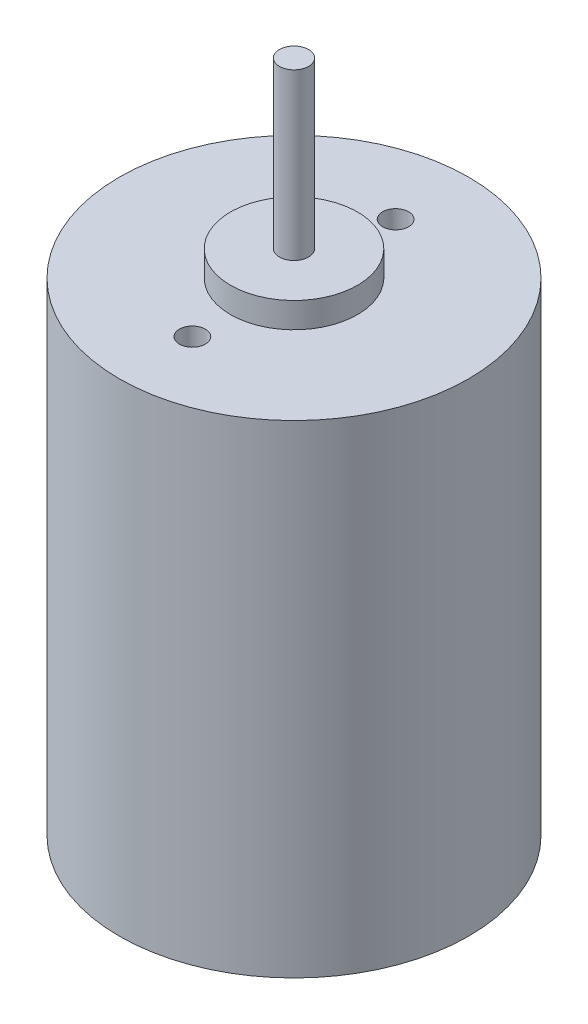
ISO-10303-21;
HEADER;
FILE_DESCRIPTION(('STEP AP214'),'2;1');
FILE_NAME('part.step','',(''),(''),'','','');
FILE_SCHEMA(('AUTOMOTIVE_DESIGN { 1 0 10303 214 1 1 1 1 }'));
ENDSEC;
DATA;
#1=APPLICATION_CONTEXT('core data for automotive mechanical design processes');
#2=APPLICATION_PROTOCOL_DEFINITION('international standard','automotive_design',2000,#1);
#3=PRODUCT_CONTEXT('',#1,'mechanical');
#4=PRODUCT('Part','Part','',(#3));
#5=PRODUCT_RELATED_PRODUCT_CATEGORY('part','',(#4));
#6=PRODUCT_DEFINITION_FORMATION('','',#4);
#7=PRODUCT_DEFINITION_CONTEXT('part definition',#1,'design');
#8=PRODUCT_DEFINITION('design','',#6,#7);
#9=PRODUCT_DEFINITION_SHAPE('','',#8);
#10=(LENGTH_UNIT() NAMED_UNIT(*) SI_UNIT(.MILLI.,.METRE.));
#11=(NAMED_UNIT(*) PLANE_ANGLE_UNIT() SI_UNIT($,.RADIAN.));
#12=(NAMED_UNIT(*) SI_UNIT($,.STERADIAN.) SOLID_ANGLE_UNIT());
#13=UNCERTAINTY_MEASURE_WITH_UNIT(LENGTH_MEASURE(1.E-05),#10,'distance_accuracy_value','');
#14=(GEOMETRIC_REPRESENTATION_CONTEXT(3) GLOBAL_UNCERTAINTY_ASSIGNED_CONTEXT((#13)) GLOBAL_UNIT_ASSIGNED_CONTEXT((#10,
#11,#12)) REPRESENTATION_CONTEXT('',''));
#15=CARTESIAN_POINT('',(0.,0.,0.));
#16=DIRECTION('',(0.,0.,1.));
#17=DIRECTION('',(1.,0.,0.));
#18=AXIS2_PLACEMENT_3D('',#15,#16,#17);
#19=CARTESIAN_POINT('',(0.,38.,0.));
#20=DIRECTION('',(0.,-1.,0.));
#21=DIRECTION('',(0.,0.,-1.));
#22=AXIS2_PLACEMENT_3D('',#19,#20,#21);
#23=CYLINDRICAL_SURFACE('',#22,13.75);
#24=CARTESIAN_POINT('',(0.,38.,0.));
#25=DIRECTION('',(0.,1.,0.));
#26=DIRECTION('',(0.,0.,1.));
#27=AXIS2_PLACEMENT_3D('',#24,#25,#26);
#28=CIRCLE('',#27,13.75);
#29=CARTESIAN_POINT('',(0.,38.,13.75));
#30=VERTEX_POINT('',#29);
#31=EDGE_CURVE('E83',#30,#30,#28,.T.);
#32=ORIENTED_EDGE('',*,*,#31,.F.);
#33=EDGE_LOOP('',(#32));
#34=FACE_BOUND('',#33,.T.);
#35=CARTESIAN_POINT('',(0.,0.,0.));
#36=DIRECTION('',(0.,1.,0.));
#37=DIRECTION('',(0.,0.,1.));
#38=AXIS2_PLACEMENT_3D('',#35,#36,#37);
#39=CIRCLE('',#38,13.75);
#40=CARTESIAN_POINT('',(0.,0.,13.75));
#41=VERTEX_POINT('',#40);
#42=EDGE_CURVE('E43',#41,#41,#39,.T.);
#43=ORIENTED_EDGE('',*,*,#42,.T.);
#44=EDGE_LOOP('',(#43));
#45=FACE_BOUND('',#44,.T.);
#46=ADVANCED_FACE('F40',(#34,#45),#23,.T.);
#47=CARTESIAN_POINT('',(0.,38.,0.));
#48=DIRECTION('',(0.,1.,0.));
#49=DIRECTION('',(0.,0.,1.));
#50=AXIS2_PLACEMENT_3D('',#47,#48,#49);
#51=PLANE('',#50);
#52=CARTESIAN_POINT('',(0.,38.,-8.));
#53=DIRECTION('',(0.,1.,0.));
#54=DIRECTION('',(0.,0.,1.));
#55=AXIS2_PLACEMENT_3D('',#52,#53,#54);
#56=CIRCLE('',#55,1.02499999999999);
#57=CARTESIAN_POINT('',(0.,38.,-6.97500000000001));
#58=VERTEX_POINT('',#57);
#59=EDGE_CURVE('E66',#58,#58,#56,.T.);
#60=ORIENTED_EDGE('',*,*,#59,.F.);
#61=EDGE_LOOP('',(#60));
#62=FACE_BOUND('',#61,.T.);
#63=CARTESIAN_POINT('',(0.,38.,8.));
#64=DIRECTION('',(0.,1.,0.));
#65=DIRECTION('',(0.,0.,1.));
#66=AXIS2_PLACEMENT_3D('',#63,#64,#65);
#67=CIRCLE('',#66,1.02499999999999);
#68=CARTESIAN_POINT('',(0.,38.,9.02499999999999));
#69=VERTEX_POINT('',#68);
#70=EDGE_CURVE('E65',#69,#69,#67,.T.);
#71=ORIENTED_EDGE('',*,*,#70,.F.);
#72=EDGE_LOOP('',(#71));
#73=FACE_BOUND('',#72,.T.);
#74=CARTESIAN_POINT('',(0.,38.,0.));
#75=DIRECTION('',(0.,1.,0.));
#76=DIRECTION('',(0.,0.,1.));
#77=AXIS2_PLACEMENT_3D('',#74,#75,#76);
#78=CIRCLE('',#77,5.);
#79=CARTESIAN_POINT('',(0.,38.,5.));
#80=VERTEX_POINT('',#79);
#81=EDGE_CURVE('E48',#80,#80,#78,.T.);
#82=ORIENTED_EDGE('',*,*,#81,.F.);
#83=EDGE_LOOP('',(#82));
#84=FACE_BOUND('',#83,.T.);
#85=ORIENTED_EDGE('',*,*,#31,.T.);
#86=EDGE_LOOP('',(#85));
#87=FACE_BOUND('',#86,.T.);
#88=ADVANCED_FACE('F94',(#62,#73,#84,#87),#51,.T.);
#89=CARTESIAN_POINT('',(0.,0.,0.));
#90=DIRECTION('',(0.,1.,0.));
#91=DIRECTION('',(0.,0.,1.));
#92=AXIS2_PLACEMENT_3D('',#89,#90,#91);
#93=PLANE('',#92);
#94=ORIENTED_EDGE('',*,*,#42,.F.);
#95=EDGE_LOOP('',(#94));
#96=FACE_BOUND('',#95,.T.);
#97=ADVANCED_FACE('F91',(#96),#93,.F.);
#98=CARTESIAN_POINT('',(0.,40.,0.));
#99=DIRECTION('',(0.,-1.,0.));
#100=DIRECTION('',(0.,0.,-1.));
#101=AXIS2_PLACEMENT_3D('',#98,#99,#100);
#102=CYLINDRICAL_SURFACE('',#101,5.);
#103=CARTESIAN_POINT('',(0.,40.,0.));
#104=DIRECTION('',(0.,1.,0.));
#105=DIRECTION('',(0.,0.,1.));
#106=AXIS2_PLACEMENT_3D('',#103,#104,#105);
#107=CIRCLE('',#106,5.);
#108=CARTESIAN_POINT('',(0.,40.,5.));
#109=VERTEX_POINT('',#108);
#110=EDGE_CURVE('E78',#109,#109,#107,.T.);
#111=ORIENTED_EDGE('',*,*,#110,.F.);
#112=EDGE_LOOP('',(#111));
#113=FACE_BOUND('',#112,.T.);
#114=ORIENTED_EDGE('',*,*,#81,.T.);
#115=EDGE_LOOP('',(#114));
#116=FACE_BOUND('',#115,.T.);
#117=ADVANCED_FACE('F93',(#113,#116),#102,.T.);
#118=CARTESIAN_POINT('',(0.,40.,0.));
#119=DIRECTION('',(0.,1.,0.));
#120=DIRECTION('',(0.,0.,1.));
#121=AXIS2_PLACEMENT_3D('',#118,#119,#120);
#122=PLANE('',#121);
#123=CARTESIAN_POINT('',(0.,40.,0.));
#124=DIRECTION('',(0.,1.,0.));
#125=DIRECTION('',(0.,0.,1.));
#126=AXIS2_PLACEMENT_3D('',#123,#124,#125);
#127=CIRCLE('',#126,1.15);
#128=CARTESIAN_POINT('',(0.,40.,1.15));
#129=VERTEX_POINT('',#128);
#130=EDGE_CURVE('E11',#129,#129,#127,.T.);
#131=ORIENTED_EDGE('',*,*,#130,.F.);
#132=EDGE_LOOP('',(#131));
#133=FACE_BOUND('',#132,.T.);
#134=ORIENTED_EDGE('',*,*,#110,.T.);
#135=EDGE_LOOP('',(#134));
#136=FACE_BOUND('',#135,.T.);
#137=ADVANCED_FACE('F99',(#133,#136),#122,.T.);
#138=CARTESIAN_POINT('',(0.,53.,0.));
#139=DIRECTION('',(0.,-1.,0.));
#140=DIRECTION('',(0.,0.,-1.));
#141=AXIS2_PLACEMENT_3D('',#138,#139,#140);
#142=CYLINDRICAL_SURFACE('',#141,1.15);
#143=CARTESIAN_POINT('',(0.,53.,0.));
#144=DIRECTION('',(0.,1.,0.));
#145=DIRECTION('',(0.,0.,1.));
#146=AXIS2_PLACEMENT_3D('',#143,#144,#145);
#147=CIRCLE('',#146,1.15);
#148=CARTESIAN_POINT('',(0.,53.,1.15));
#149=VERTEX_POINT('',#148);
#150=EDGE_CURVE('E76',#149,#149,#147,.T.);
#151=ORIENTED_EDGE('',*,*,#150,.F.);
#152=EDGE_LOOP('',(#151));
#153=FACE_BOUND('',#152,.T.);
#154=ORIENTED_EDGE('',*,*,#130,.T.);
#155=EDGE_LOOP('',(#154));
#156=FACE_BOUND('',#155,.T.);
#157=ADVANCED_FACE('F166',(#153,#156),#142,.T.);
#158=CARTESIAN_POINT('',(0.,53.,0.));
#159=DIRECTION('',(0.,1.,0.));
#160=DIRECTION('',(0.,0.,1.));
#161=AXIS2_PLACEMENT_3D('',#158,#159,#160);
#162=PLANE('',#161);
#163=ORIENTED_EDGE('',*,*,#150,.T.);
#164=EDGE_LOOP('',(#163));
#165=FACE_BOUND('',#164,.T.);
#166=ADVANCED_FACE('F119',(#165),#162,.T.);
#167=CARTESIAN_POINT('',(0.,34.25,8.));
#168=DIRECTION('',(0.,1.,0.));
#169=DIRECTION('',(0.,0.,1.));
#170=AXIS2_PLACEMENT_3D('',#167,#168,#169);
#171=CONICAL_SURFACE('',#170,1.02499999999999,1.02974425867665);
#172=CARTESIAN_POINT('',(0.,33.6341178654967,8.));
#173=VERTEX_POINT('',#172);
#174=VERTEX_LOOP('',#173);
#175=FACE_BOUND('',#174,.T.);
#176=CARTESIAN_POINT('',(0.,34.25,8.));
#177=DIRECTION('',(0.,1.,0.));
#178=DIRECTION('',(0.,0.,1.));
#179=AXIS2_PLACEMENT_3D('',#176,#177,#178);
#180=CIRCLE('',#179,1.02499999999999);
#181=CARTESIAN_POINT('',(0.,34.25,9.02499999999999));
#182=VERTEX_POINT('',#181);
#183=EDGE_CURVE('E69',#182,#182,#180,.T.);
#184=ORIENTED_EDGE('',*,*,#183,.T.);
#185=EDGE_LOOP('',(#184));
#186=FACE_BOUND('',#185,.T.);
#187=ADVANCED_FACE('F124',(#175,#186),#171,.F.);
#188=CARTESIAN_POINT('',(0.,38.,8.));
#189=DIRECTION('',(0.,1.,0.));
#190=DIRECTION('',(0.,0.,1.));
#191=AXIS2_PLACEMENT_3D('',#188,#189,#190);
#192=CYLINDRICAL_SURFACE('',#191,1.02499999999999);
#193=ORIENTED_EDGE('',*,*,#183,.F.);
#194=EDGE_LOOP('',(#193));
#195=FACE_BOUND('',#194,.T.);
#196=ORIENTED_EDGE('',*,*,#70,.T.);
#197=EDGE_LOOP('',(#196));
#198=FACE_BOUND('',#197,.T.);
#199=ADVANCED_FACE('F59',(#195,#198),#192,.F.);
#200=CARTESIAN_POINT('',(0.,34.25,-8.));
#201=DIRECTION('',(0.,1.,0.));
#202=DIRECTION('',(0.,0.,1.));
#203=AXIS2_PLACEMENT_3D('',#200,#201,#202);
#204=CONICAL_SURFACE('',#203,1.02499999999999,1.02974425867665);
#205=CARTESIAN_POINT('',(0.,33.6341178654967,-8.));
#206=VERTEX_POINT('',#205);
#207=VERTEX_LOOP('',#206);
#208=FACE_BOUND('',#207,.T.);
#209=CARTESIAN_POINT('',(0.,34.25,-8.));
#210=DIRECTION('',(0.,1.,0.));
#211=DIRECTION('',(0.,0.,1.));
#212=AXIS2_PLACEMENT_3D('',#209,#210,#211);
#213=CIRCLE('',#212,1.02499999999999);
#214=CARTESIAN_POINT('',(0.,34.25,-6.97500000000001));
#215=VERTEX_POINT('',#214);
#216=EDGE_CURVE('E63',#215,#215,#213,.T.);
#217=ORIENTED_EDGE('',*,*,#216,.T.);
#218=EDGE_LOOP('',(#217));
#219=FACE_BOUND('',#218,.T.);
#220=ADVANCED_FACE('F55',(#208,#219),#204,.F.);
#221=CARTESIAN_POINT('',(0.,38.,-8.));
#222=DIRECTION('',(0.,1.,0.));
#223=DIRECTION('',(0.,0.,1.));
#224=AXIS2_PLACEMENT_3D('',#221,#222,#223);
#225=CYLINDRICAL_SURFACE('',#224,1.02499999999999);
#226=ORIENTED_EDGE('',*,*,#216,.F.);
#227=EDGE_LOOP('',(#226));
#228=FACE_BOUND('',#227,.T.);
#229=ORIENTED_EDGE('',*,*,#59,.T.);
#230=EDGE_LOOP('',(#229));
#231=FACE_BOUND('',#230,.T.);
#232=ADVANCED_FACE('F58',(#228,#231),#225,.F.);
#233=CLOSED_SHELL('',(#46,#88,#97,#117,#137,#157,#166,#187,#199,#220,#232));
#234=MANIFOLD_SOLID_BREP('B2',#233);
#235=ADVANCED_BREP_SHAPE_REPRESENTATION('',(#18,#234),#14);
#236=SHAPE_DEFINITION_REPRESENTATION(#9,#235);
ENDSEC;
END-ISO-10303-21;
